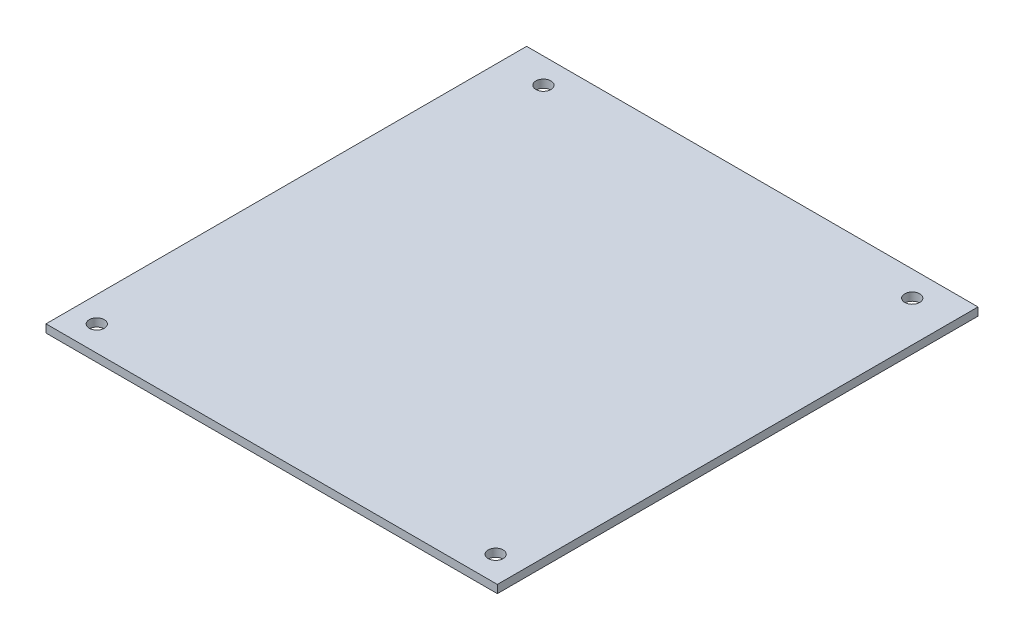
ISO-10303-21;
HEADER;
FILE_DESCRIPTION(('STEP AP214'),'2;1');
FILE_NAME('part.step','',(''),(''),'','','');
FILE_SCHEMA(('AUTOMOTIVE_DESIGN { 1 0 10303 214 1 1 1 1 }'));
ENDSEC;
DATA;
#1=APPLICATION_CONTEXT('core data for automotive mechanical design processes');
#2=APPLICATION_PROTOCOL_DEFINITION('international standard','automotive_design',2000,#1);
#3=PRODUCT_CONTEXT('',#1,'mechanical');
#4=PRODUCT('Part','Part','',(#3));
#5=PRODUCT_RELATED_PRODUCT_CATEGORY('part','',(#4));
#6=PRODUCT_DEFINITION_FORMATION('','',#4);
#7=PRODUCT_DEFINITION_CONTEXT('part definition',#1,'design');
#8=PRODUCT_DEFINITION('design','',#6,#7);
#9=PRODUCT_DEFINITION_SHAPE('','',#8);
#10=(LENGTH_UNIT() NAMED_UNIT(*) SI_UNIT(.MILLI.,.METRE.));
#11=(NAMED_UNIT(*) PLANE_ANGLE_UNIT() SI_UNIT($,.RADIAN.));
#12=(NAMED_UNIT(*) SI_UNIT($,.STERADIAN.) SOLID_ANGLE_UNIT());
#13=UNCERTAINTY_MEASURE_WITH_UNIT(LENGTH_MEASURE(1.E-05),#10,'distance_accuracy_value','');
#14=(GEOMETRIC_REPRESENTATION_CONTEXT(3) GLOBAL_UNCERTAINTY_ASSIGNED_CONTEXT((#13)) GLOBAL_UNIT_ASSIGNED_CONTEXT((#10,
#11,#12)) REPRESENTATION_CONTEXT('',''));
#15=CARTESIAN_POINT('',(0.,0.,0.));
#16=DIRECTION('',(0.,0.,1.));
#17=DIRECTION('',(1.,0.,0.));
#18=AXIS2_PLACEMENT_3D('',#15,#16,#17);
#19=CARTESIAN_POINT('',(0.,1.6,0.));
#20=DIRECTION('',(0.,-1.,0.));
#21=DIRECTION('',(0.,0.,-1.));
#22=AXIS2_PLACEMENT_3D('',#19,#20,#21);
#23=PLANE('',#22);
#24=CARTESIAN_POINT('',(79.37,1.6,-88.3));
#25=DIRECTION('',(0.,1.,0.));
#26=DIRECTION('',(0.,0.,1.));
#27=AXIS2_PLACEMENT_3D('',#24,#25,#26);
#28=CIRCLE('',#27,1.5);
#29=CARTESIAN_POINT('',(79.37,1.6,-86.8));
#30=VERTEX_POINT('',#29);
#31=EDGE_CURVE('E108',#30,#30,#28,.T.);
#32=ORIENTED_EDGE('',*,*,#31,.F.);
#33=EDGE_LOOP('',(#32));
#34=FACE_BOUND('',#33,.T.);
#35=CARTESIAN_POINT('',(5.8,1.6,-88.3));
#36=DIRECTION('',(0.,1.,0.));
#37=DIRECTION('',(0.,0.,1.));
#38=AXIS2_PLACEMENT_3D('',#35,#36,#37);
#39=CIRCLE('',#38,1.5);
#40=CARTESIAN_POINT('',(5.8,1.6,-86.8));
#41=VERTEX_POINT('',#40);
#42=EDGE_CURVE('E112',#41,#41,#39,.T.);
#43=ORIENTED_EDGE('',*,*,#42,.F.);
#44=EDGE_LOOP('',(#43));
#45=FACE_BOUND('',#44,.T.);
#46=CARTESIAN_POINT('',(82.07,1.6,-2.5));
#47=DIRECTION('',(0.,1.,0.));
#48=DIRECTION('',(0.,0.,1.));
#49=AXIS2_PLACEMENT_3D('',#46,#47,#48);
#50=CIRCLE('',#49,1.5);
#51=CARTESIAN_POINT('',(82.07,1.6,-1.));
#52=VERTEX_POINT('',#51);
#53=EDGE_CURVE('E118',#52,#52,#50,.T.);
#54=ORIENTED_EDGE('',*,*,#53,.F.);
#55=EDGE_LOOP('',(#54));
#56=FACE_BOUND('',#55,.T.);
#57=CARTESIAN_POINT('',(2.5,1.6,-2.5));
#58=DIRECTION('',(0.,1.,0.));
#59=DIRECTION('',(0.,0.,1.));
#60=AXIS2_PLACEMENT_3D('',#57,#58,#59);
#61=CIRCLE('',#60,1.5);
#62=CARTESIAN_POINT('',(2.5,1.6,-1.));
#63=VERTEX_POINT('',#62);
#64=EDGE_CURVE('E36',#63,#63,#61,.T.);
#65=ORIENTED_EDGE('',*,*,#64,.F.);
#66=EDGE_LOOP('',(#65));
#67=FACE_BOUND('',#66,.T.);
#68=DIRECTION('',(0.,0.,1.));
#69=VECTOR('',#68,1.);
#70=CARTESIAN_POINT('',(87.45,1.6,-90.8));
#71=LINE('',#70,#69);
#72=CARTESIAN_POINT('',(87.45,1.6,-93.34));
#73=VERTEX_POINT('',#72);
#74=CARTESIAN_POINT('',(87.45,1.6,2.54));
#75=VERTEX_POINT('',#74);
#76=EDGE_CURVE('E72',#73,#75,#71,.T.);
#77=ORIENTED_EDGE('',*,*,#76,.F.);
#78=DIRECTION('',(1.,0.,0.));
#79=VECTOR('',#78,1.);
#80=CARTESIAN_POINT('',(-2.59,1.6,-93.34));
#81=LINE('',#80,#79);
#82=CARTESIAN_POINT('',(-2.59,1.6,-93.34));
#83=VERTEX_POINT('',#82);
#84=EDGE_CURVE('E100',#83,#73,#81,.T.);
#85=ORIENTED_EDGE('',*,*,#84,.F.);
#86=DIRECTION('',(0.,0.,-1.));
#87=VECTOR('',#86,1.);
#88=CARTESIAN_POINT('',(-2.59,1.6,-90.8));
#89=LINE('',#88,#87);
#90=CARTESIAN_POINT('',(-2.59,1.6,2.54));
#91=VERTEX_POINT('',#90);
#92=EDGE_CURVE('E81',#91,#83,#89,.T.);
#93=ORIENTED_EDGE('',*,*,#92,.F.);
#94=DIRECTION('',(-1.,0.,0.));
#95=VECTOR('',#94,1.);
#96=CARTESIAN_POINT('',(87.45,1.6,2.54));
#97=LINE('',#96,#95);
#98=EDGE_CURVE('E84',#75,#91,#97,.T.);
#99=ORIENTED_EDGE('',*,*,#98,.F.);
#100=EDGE_LOOP('',(#77,#85,#93,#99));
#101=FACE_BOUND('',#100,.T.);
#102=ADVANCED_FACE('F32',(#34,#45,#56,#67,#101),#23,.F.);
#103=CARTESIAN_POINT('',(0.,0.,0.));
#104=DIRECTION('',(0.,-1.,0.));
#105=DIRECTION('',(0.,0.,-1.));
#106=AXIS2_PLACEMENT_3D('',#103,#104,#105);
#107=PLANE('',#106);
#108=CARTESIAN_POINT('',(79.37,0.,-88.3));
#109=DIRECTION('',(0.,1.,0.));
#110=DIRECTION('',(0.,0.,1.));
#111=AXIS2_PLACEMENT_3D('',#108,#109,#110);
#112=CIRCLE('',#111,1.5);
#113=CARTESIAN_POINT('',(79.37,0.,-86.8));
#114=VERTEX_POINT('',#113);
#115=EDGE_CURVE('E109',#114,#114,#112,.T.);
#116=ORIENTED_EDGE('',*,*,#115,.T.);
#117=EDGE_LOOP('',(#116));
#118=FACE_BOUND('',#117,.T.);
#119=CARTESIAN_POINT('',(5.8,0.,-88.3));
#120=DIRECTION('',(0.,1.,0.));
#121=DIRECTION('',(0.,0.,1.));
#122=AXIS2_PLACEMENT_3D('',#119,#120,#121);
#123=CIRCLE('',#122,1.5);
#124=CARTESIAN_POINT('',(5.8,0.,-86.8));
#125=VERTEX_POINT('',#124);
#126=EDGE_CURVE('E115',#125,#125,#123,.T.);
#127=ORIENTED_EDGE('',*,*,#126,.T.);
#128=EDGE_LOOP('',(#127));
#129=FACE_BOUND('',#128,.T.);
#130=CARTESIAN_POINT('',(82.07,0.,-2.5));
#131=DIRECTION('',(0.,1.,0.));
#132=DIRECTION('',(0.,0.,1.));
#133=AXIS2_PLACEMENT_3D('',#130,#131,#132);
#134=CIRCLE('',#133,1.5);
#135=CARTESIAN_POINT('',(82.07,0.,-1.));
#136=VERTEX_POINT('',#135);
#137=EDGE_CURVE('E121',#136,#136,#134,.T.);
#138=ORIENTED_EDGE('',*,*,#137,.T.);
#139=EDGE_LOOP('',(#138));
#140=FACE_BOUND('',#139,.T.);
#141=CARTESIAN_POINT('',(2.5,0.,-2.5));
#142=DIRECTION('',(0.,1.,0.));
#143=DIRECTION('',(0.,0.,1.));
#144=AXIS2_PLACEMENT_3D('',#141,#142,#143);
#145=CIRCLE('',#144,1.5);
#146=CARTESIAN_POINT('',(2.5,0.,-1.));
#147=VERTEX_POINT('',#146);
#148=EDGE_CURVE('E11',#147,#147,#145,.T.);
#149=ORIENTED_EDGE('',*,*,#148,.T.);
#150=EDGE_LOOP('',(#149));
#151=FACE_BOUND('',#150,.T.);
#152=DIRECTION('',(0.,0.,-1.));
#153=VECTOR('',#152,1.);
#154=CARTESIAN_POINT('',(87.45,0.,-90.8));
#155=LINE('',#154,#153);
#156=CARTESIAN_POINT('',(87.45,0.,2.54));
#157=VERTEX_POINT('',#156);
#158=CARTESIAN_POINT('',(87.45,0.,-93.34));
#159=VERTEX_POINT('',#158);
#160=EDGE_CURVE('E55',#157,#159,#155,.T.);
#161=ORIENTED_EDGE('',*,*,#160,.F.);
#162=DIRECTION('',(1.,0.,0.));
#163=VECTOR('',#162,1.);
#164=CARTESIAN_POINT('',(87.45,0.,2.54));
#165=LINE('',#164,#163);
#166=CARTESIAN_POINT('',(-2.59,0.,2.54));
#167=VERTEX_POINT('',#166);
#168=EDGE_CURVE('E92',#167,#157,#165,.T.);
#169=ORIENTED_EDGE('',*,*,#168,.F.);
#170=DIRECTION('',(0.,0.,1.));
#171=VECTOR('',#170,1.);
#172=CARTESIAN_POINT('',(-2.59,0.,-90.8));
#173=LINE('',#172,#171);
#174=CARTESIAN_POINT('',(-2.59,0.,-93.34));
#175=VERTEX_POINT('',#174);
#176=EDGE_CURVE('E47',#175,#167,#173,.T.);
#177=ORIENTED_EDGE('',*,*,#176,.F.);
#178=DIRECTION('',(-1.,0.,0.));
#179=VECTOR('',#178,1.);
#180=CARTESIAN_POINT('',(-2.59,0.,-93.34));
#181=LINE('',#180,#179);
#182=EDGE_CURVE('E103',#159,#175,#181,.T.);
#183=ORIENTED_EDGE('',*,*,#182,.F.);
#184=EDGE_LOOP('',(#161,#169,#177,#183));
#185=FACE_BOUND('',#184,.T.);
#186=ADVANCED_FACE('F34',(#118,#129,#140,#151,#185),#107,.T.);
#187=CARTESIAN_POINT('',(2.5,0.,-2.5));
#188=DIRECTION('',(0.,1.,0.));
#189=DIRECTION('',(0.,0.,1.));
#190=AXIS2_PLACEMENT_3D('',#187,#188,#189);
#191=CYLINDRICAL_SURFACE('',#190,1.5);
#192=ORIENTED_EDGE('',*,*,#148,.F.);
#193=EDGE_LOOP('',(#192));
#194=FACE_BOUND('',#193,.T.);
#195=ORIENTED_EDGE('',*,*,#64,.T.);
#196=EDGE_LOOP('',(#195));
#197=FACE_BOUND('',#196,.T.);
#198=ADVANCED_FACE('F135',(#194,#197),#191,.F.);
#199=CARTESIAN_POINT('',(82.07,0.,-2.5));
#200=DIRECTION('',(0.,1.,0.));
#201=DIRECTION('',(0.,0.,1.));
#202=AXIS2_PLACEMENT_3D('',#199,#200,#201);
#203=CYLINDRICAL_SURFACE('',#202,1.5);
#204=ORIENTED_EDGE('',*,*,#137,.F.);
#205=EDGE_LOOP('',(#204));
#206=FACE_BOUND('',#205,.T.);
#207=ORIENTED_EDGE('',*,*,#53,.T.);
#208=EDGE_LOOP('',(#207));
#209=FACE_BOUND('',#208,.T.);
#210=ADVANCED_FACE('F127',(#206,#209),#203,.F.);
#211=CARTESIAN_POINT('',(5.8,0.,-88.3));
#212=DIRECTION('',(0.,1.,0.));
#213=DIRECTION('',(0.,0.,1.));
#214=AXIS2_PLACEMENT_3D('',#211,#212,#213);
#215=CYLINDRICAL_SURFACE('',#214,1.5);
#216=ORIENTED_EDGE('',*,*,#126,.F.);
#217=EDGE_LOOP('',(#216));
#218=FACE_BOUND('',#217,.T.);
#219=ORIENTED_EDGE('',*,*,#42,.T.);
#220=EDGE_LOOP('',(#219));
#221=FACE_BOUND('',#220,.T.);
#222=ADVANCED_FACE('F143',(#218,#221),#215,.F.);
#223=CARTESIAN_POINT('',(79.37,0.,-88.3));
#224=DIRECTION('',(0.,1.,0.));
#225=DIRECTION('',(0.,0.,1.));
#226=AXIS2_PLACEMENT_3D('',#223,#224,#225);
#227=CYLINDRICAL_SURFACE('',#226,1.5);
#228=ORIENTED_EDGE('',*,*,#115,.F.);
#229=EDGE_LOOP('',(#228));
#230=FACE_BOUND('',#229,.T.);
#231=ORIENTED_EDGE('',*,*,#31,.T.);
#232=EDGE_LOOP('',(#231));
#233=FACE_BOUND('',#232,.T.);
#234=ADVANCED_FACE('F151',(#230,#233),#227,.F.);
#235=CARTESIAN_POINT('',(87.45,0.,0.));
#236=DIRECTION('',(-1.,0.,0.));
#237=DIRECTION('',(0.,0.,1.));
#238=AXIS2_PLACEMENT_3D('',#235,#236,#237);
#239=PLANE('',#238);
#240=ORIENTED_EDGE('',*,*,#160,.T.);
#241=DIRECTION('',(0.,-1.,0.));
#242=VECTOR('',#241,1.);
#243=CARTESIAN_POINT('',(87.45,0.,-93.34));
#244=LINE('',#243,#242);
#245=EDGE_CURVE('E77',#73,#159,#244,.T.);
#246=ORIENTED_EDGE('',*,*,#245,.F.);
#247=ORIENTED_EDGE('',*,*,#76,.T.);
#248=DIRECTION('',(0.,1.,0.));
#249=VECTOR('',#248,1.);
#250=CARTESIAN_POINT('',(87.45,1.6,2.54));
#251=LINE('',#250,#249);
#252=EDGE_CURVE('E76',#157,#75,#251,.T.);
#253=ORIENTED_EDGE('',*,*,#252,.F.);
#254=EDGE_LOOP('',(#240,#246,#247,#253));
#255=FACE_BOUND('',#254,.T.);
#256=ADVANCED_FACE('F74',(#255),#239,.F.);
#257=CARTESIAN_POINT('',(-2.59,0.,0.));
#258=DIRECTION('',(1.,0.,0.));
#259=DIRECTION('',(0.,0.,-1.));
#260=AXIS2_PLACEMENT_3D('',#257,#258,#259);
#261=PLANE('',#260);
#262=ORIENTED_EDGE('',*,*,#92,.T.);
#263=DIRECTION('',(0.,1.,0.));
#264=VECTOR('',#263,1.);
#265=CARTESIAN_POINT('',(-2.59,0.,-93.34));
#266=LINE('',#265,#264);
#267=EDGE_CURVE('E97',#175,#83,#266,.T.);
#268=ORIENTED_EDGE('',*,*,#267,.F.);
#269=ORIENTED_EDGE('',*,*,#176,.T.);
#270=DIRECTION('',(0.,-1.,0.));
#271=VECTOR('',#270,1.);
#272=CARTESIAN_POINT('',(-2.59,1.6,2.54));
#273=LINE('',#272,#271);
#274=EDGE_CURVE('E88',#91,#167,#273,.T.);
#275=ORIENTED_EDGE('',*,*,#274,.F.);
#276=EDGE_LOOP('',(#262,#268,#269,#275));
#277=FACE_BOUND('',#276,.T.);
#278=ADVANCED_FACE('F158',(#277),#261,.F.);
#279=CARTESIAN_POINT('',(0.,0.,-93.34));
#280=DIRECTION('',(0.,0.,-1.));
#281=DIRECTION('',(-1.,0.,0.));
#282=AXIS2_PLACEMENT_3D('',#279,#280,#281);
#283=PLANE('',#282);
#284=ORIENTED_EDGE('',*,*,#267,.T.);
#285=ORIENTED_EDGE('',*,*,#84,.T.);
#286=ORIENTED_EDGE('',*,*,#245,.T.);
#287=ORIENTED_EDGE('',*,*,#182,.T.);
#288=EDGE_LOOP('',(#284,#285,#286,#287));
#289=FACE_BOUND('',#288,.T.);
#290=ADVANCED_FACE('F161',(#289),#283,.T.);
#291=CARTESIAN_POINT('',(0.,0.,2.54));
#292=DIRECTION('',(0.,0.,-1.));
#293=DIRECTION('',(-1.,0.,0.));
#294=AXIS2_PLACEMENT_3D('',#291,#292,#293);
#295=PLANE('',#294);
#296=ORIENTED_EDGE('',*,*,#252,.T.);
#297=ORIENTED_EDGE('',*,*,#98,.T.);
#298=ORIENTED_EDGE('',*,*,#274,.T.);
#299=ORIENTED_EDGE('',*,*,#168,.T.);
#300=EDGE_LOOP('',(#296,#297,#298,#299));
#301=FACE_BOUND('',#300,.T.);
#302=ADVANCED_FACE('F91',(#301),#295,.F.);
#303=CLOSED_SHELL('',(#102,#186,#198,#210,#222,#234,#256,#278,#290,#302));
#304=MANIFOLD_SOLID_BREP('B2',#303);
#305=ADVANCED_BREP_SHAPE_REPRESENTATION('',(#18,#304),#14);
#306=SHAPE_DEFINITION_REPRESENTATION(#9,#305);
ENDSEC;
END-ISO-10303-21;
